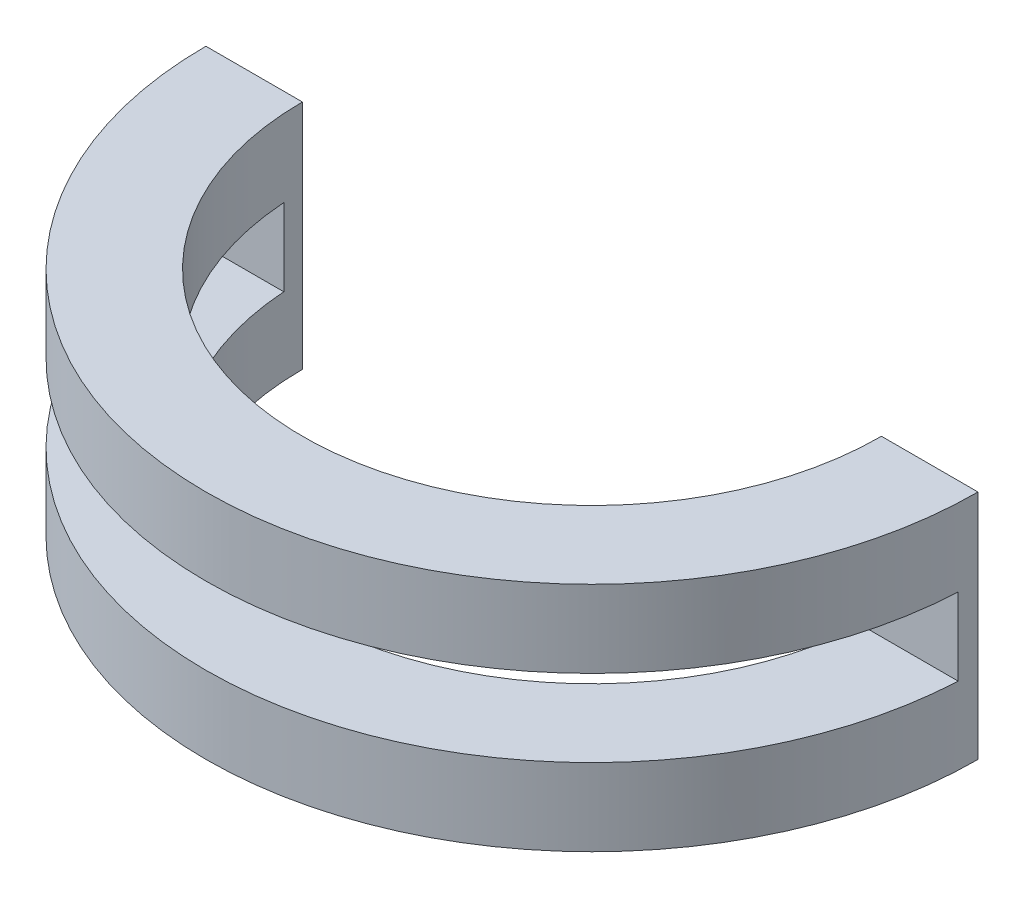
ISO-10303-21;
HEADER;
FILE_DESCRIPTION(('STEP AP214'),'2;1');
FILE_NAME('part.step','',(''),(''),'','','');
FILE_SCHEMA(('AUTOMOTIVE_DESIGN { 1 0 10303 214 1 1 1 1 }'));
ENDSEC;
DATA;
#1=APPLICATION_CONTEXT('core data for automotive mechanical design processes');
#2=APPLICATION_PROTOCOL_DEFINITION('international standard','automotive_design',2000,#1);
#3=PRODUCT_CONTEXT('',#1,'mechanical');
#4=PRODUCT('Part','Part','',(#3));
#5=PRODUCT_RELATED_PRODUCT_CATEGORY('part','',(#4));
#6=PRODUCT_DEFINITION_FORMATION('','',#4);
#7=PRODUCT_DEFINITION_CONTEXT('part definition',#1,'design');
#8=PRODUCT_DEFINITION('design','',#6,#7);
#9=PRODUCT_DEFINITION_SHAPE('','',#8);
#10=(LENGTH_UNIT() NAMED_UNIT(*) SI_UNIT(.MILLI.,.METRE.));
#11=(NAMED_UNIT(*) PLANE_ANGLE_UNIT() SI_UNIT($,.RADIAN.));
#12=(NAMED_UNIT(*) SI_UNIT($,.STERADIAN.) SOLID_ANGLE_UNIT());
#13=UNCERTAINTY_MEASURE_WITH_UNIT(LENGTH_MEASURE(1.E-05),#10,'distance_accuracy_value','');
#14=(GEOMETRIC_REPRESENTATION_CONTEXT(3) GLOBAL_UNCERTAINTY_ASSIGNED_CONTEXT((#13)) GLOBAL_UNIT_ASSIGNED_CONTEXT((#10,
#11,#12)) REPRESENTATION_CONTEXT('',''));
#15=CARTESIAN_POINT('',(0.,0.,0.));
#16=DIRECTION('',(0.,0.,1.));
#17=DIRECTION('',(1.,0.,0.));
#18=AXIS2_PLACEMENT_3D('',#15,#16,#17);
#19=CARTESIAN_POINT('',(0.,60.,0.));
#20=DIRECTION('',(0.,-1.,0.));
#21=DIRECTION('',(0.,0.,-1.));
#22=AXIS2_PLACEMENT_3D('',#19,#20,#21);
#23=CYLINDRICAL_SURFACE('',#22,75.);
#24=DIRECTION('',(0.,-1.,0.));
#25=VECTOR('',#24,1.);
#26=CARTESIAN_POINT('',(74.8331477354788,40.,4.99999999999999));
#27=LINE('',#26,#25);
#28=CARTESIAN_POINT('',(74.8331477354788,40.,4.99999999999999));
#29=VERTEX_POINT('',#28);
#30=CARTESIAN_POINT('',(74.8331477354788,20.,4.99999999999999));
#31=VERTEX_POINT('',#30);
#32=EDGE_CURVE('E103',#29,#31,#27,.T.);
#33=ORIENTED_EDGE('',*,*,#32,.F.);
#34=CARTESIAN_POINT('',(0.,40.,0.));
#35=DIRECTION('',(0.,-1.,0.));
#36=DIRECTION('',(0.,0.,1.));
#37=AXIS2_PLACEMENT_3D('',#34,#35,#36);
#38=CIRCLE('',#37,75.);
#39=CARTESIAN_POINT('',(-74.8331477354788,40.,5.));
#40=VERTEX_POINT('',#39);
#41=EDGE_CURVE('E257',#29,#40,#38,.T.);
#42=ORIENTED_EDGE('',*,*,#41,.T.);
#43=DIRECTION('',(0.,-1.,0.));
#44=VECTOR('',#43,1.);
#45=CARTESIAN_POINT('',(-74.8331477354788,40.,5.));
#46=LINE('',#45,#44);
#47=CARTESIAN_POINT('',(-74.8331477354788,20.,5.));
#48=VERTEX_POINT('',#47);
#49=EDGE_CURVE('E122',#40,#48,#46,.T.);
#50=ORIENTED_EDGE('',*,*,#49,.T.);
#51=CARTESIAN_POINT('',(0.,20.,0.));
#52=DIRECTION('',(0.,-1.,0.));
#53=DIRECTION('',(0.,0.,1.));
#54=AXIS2_PLACEMENT_3D('',#51,#52,#53);
#55=CIRCLE('',#54,75.);
#56=EDGE_CURVE('E105',#31,#48,#55,.T.);
#57=ORIENTED_EDGE('',*,*,#56,.F.);
#58=EDGE_LOOP('',(#33,#42,#50,#57));
#59=FACE_BOUND('',#58,.T.);
#60=CARTESIAN_POINT('',(0.,0.,0.));
#61=DIRECTION('',(0.,-1.,0.));
#62=DIRECTION('',(0.,0.,1.));
#63=AXIS2_PLACEMENT_3D('',#60,#61,#62);
#64=CIRCLE('',#63,75.);
#65=CARTESIAN_POINT('',(75.,0.,0.));
#66=VERTEX_POINT('',#65);
#67=CARTESIAN_POINT('',(-75.,0.,0.));
#68=VERTEX_POINT('',#67);
#69=EDGE_CURVE('E117',#66,#68,#64,.T.);
#70=ORIENTED_EDGE('',*,*,#69,.T.);
#71=DIRECTION('',(0.,-1.,0.));
#72=VECTOR('',#71,1.);
#73=CARTESIAN_POINT('',(-75.,60.,0.));
#74=LINE('',#73,#72);
#75=CARTESIAN_POINT('',(-75.,60.,0.));
#76=VERTEX_POINT('',#75);
#77=EDGE_CURVE('E11',#76,#68,#74,.T.);
#78=ORIENTED_EDGE('',*,*,#77,.F.);
#79=CARTESIAN_POINT('',(0.,60.,0.));
#80=DIRECTION('',(0.,-1.,0.));
#81=DIRECTION('',(0.,0.,1.));
#82=AXIS2_PLACEMENT_3D('',#79,#80,#81);
#83=CIRCLE('',#82,75.);
#84=CARTESIAN_POINT('',(75.,60.,0.));
#85=VERTEX_POINT('',#84);
#86=EDGE_CURVE('E126',#85,#76,#83,.T.);
#87=ORIENTED_EDGE('',*,*,#86,.F.);
#88=DIRECTION('',(0.,-1.,0.));
#89=VECTOR('',#88,1.);
#90=CARTESIAN_POINT('',(75.,60.,0.));
#91=LINE('',#90,#89);
#92=EDGE_CURVE('E135',#85,#66,#91,.T.);
#93=ORIENTED_EDGE('',*,*,#92,.T.);
#94=EDGE_LOOP('',(#70,#78,#87,#93));
#95=FACE_BOUND('',#94,.T.);
#96=ADVANCED_FACE('F36',(#59,#95),#23,.F.);
#97=CARTESIAN_POINT('',(-100.,60.,0.));
#98=DIRECTION('',(0.,0.,1.));
#99=DIRECTION('',(1.,0.,0.));
#100=AXIS2_PLACEMENT_3D('',#97,#98,#99);
#101=PLANE('',#100);
#102=DIRECTION('',(-1.,0.,0.));
#103=VECTOR('',#102,1.);
#104=CARTESIAN_POINT('',(-100.,0.,0.));
#105=LINE('',#104,#103);
#106=CARTESIAN_POINT('',(-100.,0.,0.));
#107=VERTEX_POINT('',#106);
#108=EDGE_CURVE('E120',#68,#107,#105,.T.);
#109=ORIENTED_EDGE('',*,*,#108,.T.);
#110=DIRECTION('',(0.,-1.,0.));
#111=VECTOR('',#110,1.);
#112=CARTESIAN_POINT('',(-100.,60.,0.));
#113=LINE('',#112,#111);
#114=CARTESIAN_POINT('',(-100.,60.,0.));
#115=VERTEX_POINT('',#114);
#116=EDGE_CURVE('E43',#115,#107,#113,.T.);
#117=ORIENTED_EDGE('',*,*,#116,.F.);
#118=DIRECTION('',(-1.,0.,0.));
#119=VECTOR('',#118,1.);
#120=CARTESIAN_POINT('',(-100.,60.,0.));
#121=LINE('',#120,#119);
#122=EDGE_CURVE('E129',#76,#115,#121,.T.);
#123=ORIENTED_EDGE('',*,*,#122,.F.);
#124=ORIENTED_EDGE('',*,*,#77,.T.);
#125=EDGE_LOOP('',(#109,#117,#123,#124));
#126=FACE_BOUND('',#125,.T.);
#127=ADVANCED_FACE('F164',(#126),#101,.F.);
#128=CARTESIAN_POINT('',(0.,60.,0.));
#129=DIRECTION('',(0.,-1.,0.));
#130=DIRECTION('',(0.,0.,-1.));
#131=AXIS2_PLACEMENT_3D('',#128,#129,#130);
#132=CYLINDRICAL_SURFACE('',#131,100.);
#133=DIRECTION('',(0.,-1.,0.));
#134=VECTOR('',#133,1.);
#135=CARTESIAN_POINT('',(-99.8749217771909,40.,5.));
#136=LINE('',#135,#134);
#137=CARTESIAN_POINT('',(-99.8749217771909,40.,5.));
#138=VERTEX_POINT('',#137);
#139=CARTESIAN_POINT('',(-99.8749217771909,20.,5.));
#140=VERTEX_POINT('',#139);
#141=EDGE_CURVE('E254',#138,#140,#136,.T.);
#142=ORIENTED_EDGE('',*,*,#141,.F.);
#143=CARTESIAN_POINT('',(0.,40.,0.));
#144=DIRECTION('',(0.,1.,0.));
#145=DIRECTION('',(0.,0.,1.));
#146=AXIS2_PLACEMENT_3D('',#143,#144,#145);
#147=CIRCLE('',#146,100.);
#148=CARTESIAN_POINT('',(99.8749217771909,40.,5.));
#149=VERTEX_POINT('',#148);
#150=EDGE_CURVE('E116',#138,#149,#147,.T.);
#151=ORIENTED_EDGE('',*,*,#150,.T.);
#152=DIRECTION('',(0.,-1.,0.));
#153=VECTOR('',#152,1.);
#154=CARTESIAN_POINT('',(99.8749217771909,40.,5.));
#155=LINE('',#154,#153);
#156=CARTESIAN_POINT('',(99.8749217771909,20.,5.));
#157=VERTEX_POINT('',#156);
#158=EDGE_CURVE('E100',#149,#157,#155,.T.);
#159=ORIENTED_EDGE('',*,*,#158,.T.);
#160=CARTESIAN_POINT('',(0.,20.,0.));
#161=DIRECTION('',(0.,1.,0.));
#162=DIRECTION('',(0.,0.,1.));
#163=AXIS2_PLACEMENT_3D('',#160,#161,#162);
#164=CIRCLE('',#163,100.);
#165=EDGE_CURVE('E106',#140,#157,#164,.T.);
#166=ORIENTED_EDGE('',*,*,#165,.F.);
#167=EDGE_LOOP('',(#142,#151,#159,#166));
#168=FACE_BOUND('',#167,.T.);
#169=CARTESIAN_POINT('',(0.,0.,0.));
#170=DIRECTION('',(0.,1.,0.));
#171=DIRECTION('',(0.,0.,1.));
#172=AXIS2_PLACEMENT_3D('',#169,#170,#171);
#173=CIRCLE('',#172,100.);
#174=CARTESIAN_POINT('',(100.,0.,0.));
#175=VERTEX_POINT('',#174);
#176=EDGE_CURVE('E138',#107,#175,#173,.T.);
#177=ORIENTED_EDGE('',*,*,#176,.T.);
#178=DIRECTION('',(0.,-1.,0.));
#179=VECTOR('',#178,1.);
#180=CARTESIAN_POINT('',(100.,60.,0.));
#181=LINE('',#180,#179);
#182=CARTESIAN_POINT('',(100.,60.,0.));
#183=VERTEX_POINT('',#182);
#184=EDGE_CURVE('E143',#183,#175,#181,.T.);
#185=ORIENTED_EDGE('',*,*,#184,.F.);
#186=CARTESIAN_POINT('',(0.,60.,0.));
#187=DIRECTION('',(0.,1.,0.));
#188=DIRECTION('',(0.,0.,1.));
#189=AXIS2_PLACEMENT_3D('',#186,#187,#188);
#190=CIRCLE('',#189,100.);
#191=EDGE_CURVE('E132',#115,#183,#190,.T.);
#192=ORIENTED_EDGE('',*,*,#191,.F.);
#193=ORIENTED_EDGE('',*,*,#116,.T.);
#194=EDGE_LOOP('',(#177,#185,#192,#193));
#195=FACE_BOUND('',#194,.T.);
#196=ADVANCED_FACE('F113',(#168,#195),#132,.T.);
#197=CARTESIAN_POINT('',(75.,60.,0.));
#198=DIRECTION('',(0.,0.,1.));
#199=DIRECTION('',(1.,0.,0.));
#200=AXIS2_PLACEMENT_3D('',#197,#198,#199);
#201=PLANE('',#200);
#202=DIRECTION('',(-1.,0.,0.));
#203=VECTOR('',#202,1.);
#204=CARTESIAN_POINT('',(75.,0.,0.));
#205=LINE('',#204,#203);
#206=EDGE_CURVE('E130',#175,#66,#205,.T.);
#207=ORIENTED_EDGE('',*,*,#206,.T.);
#208=ORIENTED_EDGE('',*,*,#92,.F.);
#209=DIRECTION('',(-1.,0.,0.));
#210=VECTOR('',#209,1.);
#211=CARTESIAN_POINT('',(75.,60.,0.));
#212=LINE('',#211,#210);
#213=EDGE_CURVE('E134',#183,#85,#212,.T.);
#214=ORIENTED_EDGE('',*,*,#213,.F.);
#215=ORIENTED_EDGE('',*,*,#184,.T.);
#216=EDGE_LOOP('',(#207,#208,#214,#215));
#217=FACE_BOUND('',#216,.T.);
#218=ADVANCED_FACE('F157',(#217),#201,.F.);
#219=CARTESIAN_POINT('',(0.,60.,0.));
#220=DIRECTION('',(0.,1.,0.));
#221=DIRECTION('',(0.,0.,1.));
#222=AXIS2_PLACEMENT_3D('',#219,#220,#221);
#223=PLANE('',#222);
#224=ORIENTED_EDGE('',*,*,#86,.T.);
#225=ORIENTED_EDGE('',*,*,#122,.T.);
#226=ORIENTED_EDGE('',*,*,#191,.T.);
#227=ORIENTED_EDGE('',*,*,#213,.T.);
#228=EDGE_LOOP('',(#224,#225,#226,#227));
#229=FACE_BOUND('',#228,.T.);
#230=ADVANCED_FACE('F163',(#229),#223,.T.);
#231=CARTESIAN_POINT('',(0.,0.,0.));
#232=DIRECTION('',(0.,1.,0.));
#233=DIRECTION('',(0.,0.,1.));
#234=AXIS2_PLACEMENT_3D('',#231,#232,#233);
#235=PLANE('',#234);
#236=ORIENTED_EDGE('',*,*,#69,.F.);
#237=ORIENTED_EDGE('',*,*,#206,.F.);
#238=ORIENTED_EDGE('',*,*,#176,.F.);
#239=ORIENTED_EDGE('',*,*,#108,.F.);
#240=EDGE_LOOP('',(#236,#237,#238,#239));
#241=FACE_BOUND('',#240,.T.);
#242=ADVANCED_FACE('F154',(#241),#235,.F.);
#243=CARTESIAN_POINT('',(74.8331477354788,40.,5.));
#244=DIRECTION('',(0.,0.,1.));
#245=DIRECTION('',(1.,0.,0.));
#246=AXIS2_PLACEMENT_3D('',#243,#244,#245);
#247=PLANE('',#246);
#248=ORIENTED_EDGE('',*,*,#158,.F.);
#249=DIRECTION('',(-1.,0.,0.));
#250=VECTOR('',#249,1.);
#251=CARTESIAN_POINT('',(74.8331477354788,40.,5.));
#252=LINE('',#251,#250);
#253=EDGE_CURVE('E252',#149,#29,#252,.T.);
#254=ORIENTED_EDGE('',*,*,#253,.T.);
#255=ORIENTED_EDGE('',*,*,#32,.T.);
#256=DIRECTION('',(-1.,0.,0.));
#257=VECTOR('',#256,1.);
#258=CARTESIAN_POINT('',(74.8331477354788,20.,5.));
#259=LINE('',#258,#257);
#260=EDGE_CURVE('E50',#157,#31,#259,.T.);
#261=ORIENTED_EDGE('',*,*,#260,.F.);
#262=EDGE_LOOP('',(#248,#254,#255,#261));
#263=FACE_BOUND('',#262,.T.);
#264=ADVANCED_FACE('F98',(#263),#247,.T.);
#265=CARTESIAN_POINT('',(-99.8749217771909,40.,5.));
#266=DIRECTION('',(0.,0.,1.));
#267=DIRECTION('',(1.,0.,0.));
#268=AXIS2_PLACEMENT_3D('',#265,#266,#267);
#269=PLANE('',#268);
#270=ORIENTED_EDGE('',*,*,#49,.F.);
#271=DIRECTION('',(-1.,0.,0.));
#272=VECTOR('',#271,1.);
#273=CARTESIAN_POINT('',(-99.8749217771909,40.,5.));
#274=LINE('',#273,#272);
#275=EDGE_CURVE('E250',#40,#138,#274,.T.);
#276=ORIENTED_EDGE('',*,*,#275,.T.);
#277=ORIENTED_EDGE('',*,*,#141,.T.);
#278=DIRECTION('',(-1.,0.,0.));
#279=VECTOR('',#278,1.);
#280=CARTESIAN_POINT('',(-99.8749217771909,20.,5.));
#281=LINE('',#280,#279);
#282=EDGE_CURVE('E55',#48,#140,#281,.T.);
#283=ORIENTED_EDGE('',*,*,#282,.F.);
#284=EDGE_LOOP('',(#270,#276,#277,#283));
#285=FACE_BOUND('',#284,.T.);
#286=ADVANCED_FACE('F181',(#285),#269,.T.);
#287=CARTESIAN_POINT('',(0.,40.,0.));
#288=DIRECTION('',(0.,1.,0.));
#289=DIRECTION('',(0.,0.,1.));
#290=AXIS2_PLACEMENT_3D('',#287,#288,#289);
#291=PLANE('',#290);
#292=ORIENTED_EDGE('',*,*,#150,.F.);
#293=ORIENTED_EDGE('',*,*,#275,.F.);
#294=ORIENTED_EDGE('',*,*,#41,.F.);
#295=ORIENTED_EDGE('',*,*,#253,.F.);
#296=EDGE_LOOP('',(#292,#293,#294,#295));
#297=FACE_BOUND('',#296,.T.);
#298=ADVANCED_FACE('F184',(#297),#291,.F.);
#299=CARTESIAN_POINT('',(0.,20.,0.));
#300=DIRECTION('',(0.,1.,0.));
#301=DIRECTION('',(0.,0.,1.));
#302=AXIS2_PLACEMENT_3D('',#299,#300,#301);
#303=PLANE('',#302);
#304=ORIENTED_EDGE('',*,*,#165,.T.);
#305=ORIENTED_EDGE('',*,*,#260,.T.);
#306=ORIENTED_EDGE('',*,*,#56,.T.);
#307=ORIENTED_EDGE('',*,*,#282,.T.);
#308=EDGE_LOOP('',(#304,#305,#306,#307));
#309=FACE_BOUND('',#308,.T.);
#310=ADVANCED_FACE('F109',(#309),#303,.T.);
#311=CLOSED_SHELL('',(#96,#127,#196,#218,#230,#242,#264,#286,#298,#310));
#312=MANIFOLD_SOLID_BREP('B2',#311);
#313=ADVANCED_BREP_SHAPE_REPRESENTATION('',(#18,#312),#14);
#314=SHAPE_DEFINITION_REPRESENTATION(#9,#313);
ENDSEC;
END-ISO-10303-21;
